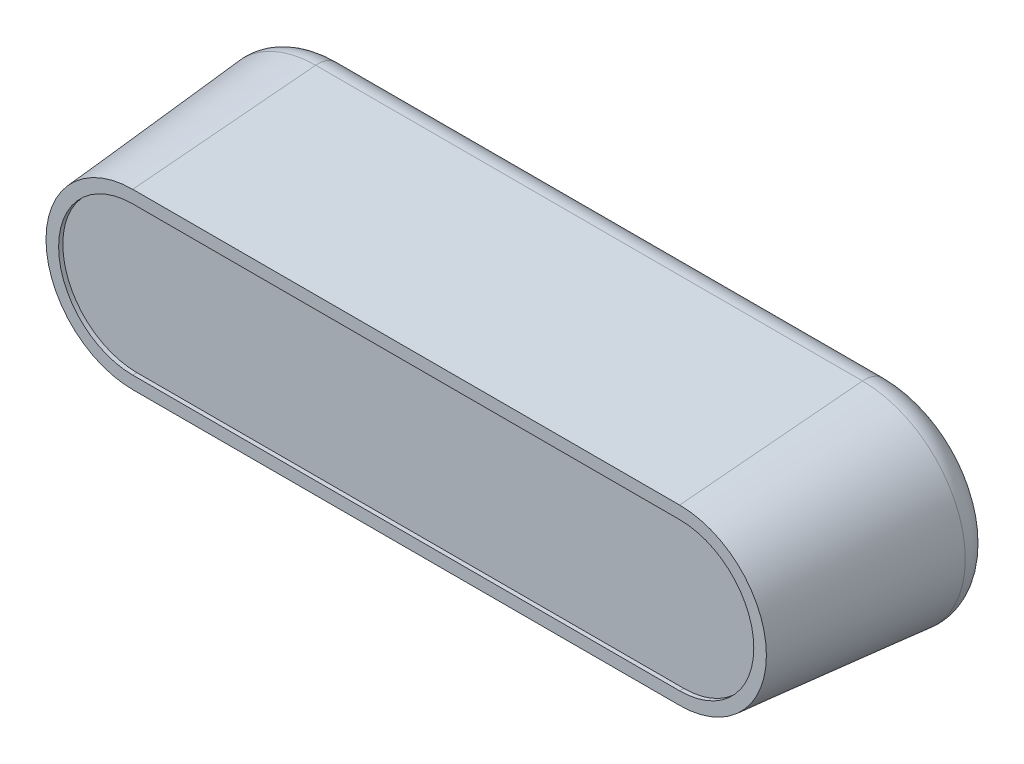
ISO-10303-21;
HEADER;
FILE_DESCRIPTION(('STEP AP214'),'2;1');
FILE_NAME('part.step','',(''),(''),'','','');
FILE_SCHEMA(('AUTOMOTIVE_DESIGN { 1 0 10303 214 1 1 1 1 }'));
ENDSEC;
DATA;
#1=APPLICATION_CONTEXT('core data for automotive mechanical design processes');
#2=APPLICATION_PROTOCOL_DEFINITION('international standard','automotive_design',2000,#1);
#3=PRODUCT_CONTEXT('',#1,'mechanical');
#4=PRODUCT('Part','Part','',(#3));
#5=PRODUCT_RELATED_PRODUCT_CATEGORY('part','',(#4));
#6=PRODUCT_DEFINITION_FORMATION('','',#4);
#7=PRODUCT_DEFINITION_CONTEXT('part definition',#1,'design');
#8=PRODUCT_DEFINITION('design','',#6,#7);
#9=PRODUCT_DEFINITION_SHAPE('','',#8);
#10=(LENGTH_UNIT() NAMED_UNIT(*) SI_UNIT(.MILLI.,.METRE.));
#11=(NAMED_UNIT(*) PLANE_ANGLE_UNIT() SI_UNIT($,.RADIAN.));
#12=(NAMED_UNIT(*) SI_UNIT($,.STERADIAN.) SOLID_ANGLE_UNIT());
#13=UNCERTAINTY_MEASURE_WITH_UNIT(LENGTH_MEASURE(1.E-05),#10,'distance_accuracy_value','');
#14=(GEOMETRIC_REPRESENTATION_CONTEXT(3) GLOBAL_UNCERTAINTY_ASSIGNED_CONTEXT((#13)) GLOBAL_UNIT_ASSIGNED_CONTEXT((#10,
#11,#12)) REPRESENTATION_CONTEXT('',''));
#15=CARTESIAN_POINT('',(0.,0.,0.));
#16=DIRECTION('',(0.,0.,1.));
#17=DIRECTION('',(1.,0.,0.));
#18=AXIS2_PLACEMENT_3D('',#15,#16,#17);
#19=CARTESIAN_POINT('',(-32.5,-12.5,0.));
#20=DIRECTION('',(0.,-0.996194698091746,0.0871557427476583));
#21=DIRECTION('',(0.,-0.0871557427476583,-0.996194698091746));
#22=AXIS2_PLACEMENT_3D('',#19,#20,#21);
#23=PLANE('',#22);
#24=DIRECTION('',(-1.,0.,0.));
#25=VECTOR('',#24,1.);
#26=CARTESIAN_POINT('',(32.5,-11.4272606193341,12.261467228243));
#27=LINE('',#26,#25);
#28=CARTESIAN_POINT('',(-32.5,-11.4272606193341,12.261467228243));
#29=VERTEX_POINT('',#28);
#30=CARTESIAN_POINT('',(32.5,-11.4272606193341,12.261467228243));
#31=VERTEX_POINT('',#30);
#32=EDGE_CURVE('E61',#29,#31,#27,.F.);
#33=ORIENTED_EDGE('',*,*,#32,.T.);
#34=DIRECTION('',(0.,-0.0871557427476583,-0.996194698091745));
#35=VECTOR('',#34,1.);
#36=CARTESIAN_POINT('',(32.5,-12.5,0.));
#37=LINE('',#36,#35);
#38=CARTESIAN_POINT('',(32.5,-10.3127834118519,25.));
#39=VERTEX_POINT('',#38);
#40=EDGE_CURVE('E163',#39,#31,#37,.T.);
#41=ORIENTED_EDGE('',*,*,#40,.F.);
#42=DIRECTION('',(-1.,0.,0.));
#43=VECTOR('',#42,1.);
#44=CARTESIAN_POINT('',(-32.5,-10.3127834118519,25.));
#45=LINE('',#44,#43);
#46=CARTESIAN_POINT('',(-32.5,-10.3127834118519,25.));
#47=VERTEX_POINT('',#46);
#48=EDGE_CURVE('E237',#47,#39,#45,.F.);
#49=ORIENTED_EDGE('',*,*,#48,.F.);
#50=DIRECTION('',(0.,-0.0871557427476583,-0.996194698091745));
#51=VECTOR('',#50,1.);
#52=CARTESIAN_POINT('',(-32.5,-12.5,0.));
#53=LINE('',#52,#51);
#54=EDGE_CURVE('E176',#47,#29,#53,.T.);
#55=ORIENTED_EDGE('',*,*,#54,.T.);
#56=EDGE_LOOP('',(#33,#41,#49,#55));
#57=FACE_BOUND('',#56,.T.);
#58=ADVANCED_FACE('F38',(#57),#23,.T.);
#59=CARTESIAN_POINT('',(-32.5,0.,0.));
#60=DIRECTION('',(0.,0.,-1.));
#61=DIRECTION('',(1.,0.,0.));
#62=AXIS2_PLACEMENT_3D('',#59,#60,#61);
#63=CONICAL_SURFACE('',#62,12.5,0.0872664625997166);
#64=DIRECTION('',(0.,0.0871557427476583,-0.996194698091745));
#65=VECTOR('',#64,1.);
#66=CARTESIAN_POINT('',(-32.5,12.5,0.));
#67=LINE('',#66,#65);
#68=CARTESIAN_POINT('',(-32.5,10.3127834118519,25.));
#69=VERTEX_POINT('',#68);
#70=CARTESIAN_POINT('',(-32.5,12.2146585910674,3.26146722824297));
#71=VERTEX_POINT('',#70);
#72=EDGE_CURVE('E227',#69,#71,#67,.T.);
#73=ORIENTED_EDGE('',*,*,#72,.T.);
#74=CARTESIAN_POINT('',(-32.5,0.,3.26146722824297));
#75=DIRECTION('',(0.,0.,1.));
#76=DIRECTION('',(1.,0.,0.));
#77=AXIS2_PLACEMENT_3D('',#74,#75,#76);
#78=CIRCLE('',#77,12.2146585910674);
#79=CARTESIAN_POINT('',(-32.5,-12.2146585910674,3.26146722824297));
#80=VERTEX_POINT('',#79);
#81=EDGE_CURVE('E11',#71,#80,#78,.T.);
#82=ORIENTED_EDGE('',*,*,#81,.T.);
#83=DIRECTION('',(0.,-0.0871557427476583,-0.996194698091746));
#84=VECTOR('',#83,1.);
#85=CARTESIAN_POINT('',(-32.5,0.,142.875653784517));
#86=LINE('',#85,#84);
#87=EDGE_CURVE('E54',#80,#29,#86,.F.);
#88=ORIENTED_EDGE('',*,*,#87,.T.);
#89=ORIENTED_EDGE('',*,*,#54,.F.);
#90=CARTESIAN_POINT('',(-32.5,0.,25.));
#91=DIRECTION('',(0.,0.,1.));
#92=DIRECTION('',(1.,0.,0.));
#93=AXIS2_PLACEMENT_3D('',#90,#91,#92);
#94=CIRCLE('',#93,10.3127834118519);
#95=EDGE_CURVE('E234',#69,#47,#94,.T.);
#96=ORIENTED_EDGE('',*,*,#95,.F.);
#97=EDGE_LOOP('',(#73,#82,#88,#89,#96));
#98=FACE_BOUND('',#97,.T.);
#99=ADVANCED_FACE('F273',(#98),#63,.T.);
#100=CARTESIAN_POINT('',(32.5,0.,0.));
#101=DIRECTION('',(0.,0.,-1.));
#102=DIRECTION('',(1.,0.,0.));
#103=AXIS2_PLACEMENT_3D('',#100,#101,#102);
#104=CONICAL_SURFACE('',#103,12.5,0.0872664625997166);
#105=ORIENTED_EDGE('',*,*,#40,.T.);
#106=DIRECTION('',(0.,0.0871557427476583,0.996194698091746));
#107=VECTOR('',#106,1.);
#108=CARTESIAN_POINT('',(32.5,-12.0289885720037,5.38368525719598));
#109=LINE('',#108,#107);
#110=CARTESIAN_POINT('',(32.5,-12.2146585910674,3.26146722824297));
#111=VERTEX_POINT('',#110);
#112=EDGE_CURVE('E160',#31,#111,#109,.F.);
#113=ORIENTED_EDGE('',*,*,#112,.T.);
#114=CARTESIAN_POINT('',(32.5,0.,3.26146722824297));
#115=DIRECTION('',(0.,0.,1.));
#116=DIRECTION('',(1.,0.,0.));
#117=AXIS2_PLACEMENT_3D('',#114,#115,#116);
#118=CIRCLE('',#117,12.2146585910674);
#119=CARTESIAN_POINT('',(32.5,12.2146585910674,3.26146722824297));
#120=VERTEX_POINT('',#119);
#121=EDGE_CURVE('E136',#111,#120,#118,.T.);
#122=ORIENTED_EDGE('',*,*,#121,.T.);
#123=DIRECTION('',(0.,0.0871557427476583,-0.996194698091745));
#124=VECTOR('',#123,1.);
#125=CARTESIAN_POINT('',(32.5,12.5,0.));
#126=LINE('',#125,#124);
#127=CARTESIAN_POINT('',(32.5,10.3127834118519,25.));
#128=VERTEX_POINT('',#127);
#129=EDGE_CURVE('E230',#128,#120,#126,.T.);
#130=ORIENTED_EDGE('',*,*,#129,.F.);
#131=CARTESIAN_POINT('',(32.5,0.,25.));
#132=DIRECTION('',(0.,0.,1.));
#133=DIRECTION('',(1.,0.,0.));
#134=AXIS2_PLACEMENT_3D('',#131,#132,#133);
#135=CIRCLE('',#134,10.3127834118519);
#136=EDGE_CURVE('E239',#39,#128,#135,.T.);
#137=ORIENTED_EDGE('',*,*,#136,.F.);
#138=EDGE_LOOP('',(#105,#113,#122,#130,#137));
#139=FACE_BOUND('',#138,.T.);
#140=ADVANCED_FACE('F161',(#139),#104,.T.);
#141=CARTESIAN_POINT('',(-32.5,12.5,0.));
#142=DIRECTION('',(0.,0.996194698091746,0.0871557427476583));
#143=DIRECTION('',(0.,-0.0871557427476583,0.996194698091746));
#144=AXIS2_PLACEMENT_3D('',#141,#142,#143);
#145=PLANE('',#144);
#146=ORIENTED_EDGE('',*,*,#129,.T.);
#147=DIRECTION('',(-1.,0.,0.));
#148=VECTOR('',#147,1.);
#149=CARTESIAN_POINT('',(-32.5,12.2146585910674,3.26146722824298));
#150=LINE('',#149,#148);
#151=EDGE_CURVE('E47',#120,#71,#150,.T.);
#152=ORIENTED_EDGE('',*,*,#151,.T.);
#153=ORIENTED_EDGE('',*,*,#72,.F.);
#154=DIRECTION('',(1.,0.,0.));
#155=VECTOR('',#154,1.);
#156=CARTESIAN_POINT('',(-32.5,10.3127834118519,25.));
#157=LINE('',#156,#155);
#158=EDGE_CURVE('E231',#128,#69,#157,.F.);
#159=ORIENTED_EDGE('',*,*,#158,.F.);
#160=EDGE_LOOP('',(#146,#152,#153,#159));
#161=FACE_BOUND('',#160,.T.);
#162=ADVANCED_FACE('F268',(#161),#145,.T.);
#163=CARTESIAN_POINT('',(-32.5,0.,25.));
#164=DIRECTION('',(0.,0.,1.));
#165=DIRECTION('',(1.,0.,0.));
#166=AXIS2_PLACEMENT_3D('',#163,#164,#165);
#167=PLANE('',#166);
#168=DIRECTION('',(1.,0.,0.));
#169=VECTOR('',#168,1.);
#170=CARTESIAN_POINT('',(0.,-8.8127834118519,25.));
#171=LINE('',#170,#169);
#172=CARTESIAN_POINT('',(-32.5,-8.8127834118519,25.));
#173=VERTEX_POINT('',#172);
#174=CARTESIAN_POINT('',(32.5,-8.81278341185189,25.));
#175=VERTEX_POINT('',#174);
#176=EDGE_CURVE('E209',#173,#175,#171,.T.);
#177=ORIENTED_EDGE('',*,*,#176,.F.);
#178=CARTESIAN_POINT('',(-32.5,0.,25.));
#179=DIRECTION('',(0.,0.,1.));
#180=DIRECTION('',(1.,0.,0.));
#181=AXIS2_PLACEMENT_3D('',#178,#179,#180);
#182=CIRCLE('',#181,8.8127834118519);
#183=CARTESIAN_POINT('',(-32.5,8.81278341185191,25.));
#184=VERTEX_POINT('',#183);
#185=EDGE_CURVE('E199',#184,#173,#182,.T.);
#186=ORIENTED_EDGE('',*,*,#185,.F.);
#187=DIRECTION('',(-1.,0.,0.));
#188=VECTOR('',#187,1.);
#189=CARTESIAN_POINT('',(0.,8.81278341185191,25.));
#190=LINE('',#189,#188);
#191=CARTESIAN_POINT('',(32.5,8.81278341185191,25.));
#192=VERTEX_POINT('',#191);
#193=EDGE_CURVE('E214',#192,#184,#190,.T.);
#194=ORIENTED_EDGE('',*,*,#193,.F.);
#195=CARTESIAN_POINT('',(32.5,0.,25.));
#196=DIRECTION('',(0.,0.,1.));
#197=DIRECTION('',(1.,0.,0.));
#198=AXIS2_PLACEMENT_3D('',#195,#196,#197);
#199=CIRCLE('',#198,8.8127834118519);
#200=EDGE_CURVE('E211',#175,#192,#199,.T.);
#201=ORIENTED_EDGE('',*,*,#200,.F.);
#202=EDGE_LOOP('',(#177,#186,#194,#201));
#203=FACE_BOUND('',#202,.T.);
#204=ORIENTED_EDGE('',*,*,#95,.T.);
#205=ORIENTED_EDGE('',*,*,#48,.T.);
#206=ORIENTED_EDGE('',*,*,#136,.T.);
#207=ORIENTED_EDGE('',*,*,#158,.T.);
#208=EDGE_LOOP('',(#204,#205,#206,#207));
#209=FACE_BOUND('',#208,.T.);
#210=ADVANCED_FACE('F262',(#203,#209),#167,.T.);
#211=CARTESIAN_POINT('',(-32.5,0.,0.));
#212=DIRECTION('',(0.,0.,1.));
#213=DIRECTION('',(1.,0.,0.));
#214=AXIS2_PLACEMENT_3D('',#211,#212,#213);
#215=PLANE('',#214);
#216=CARTESIAN_POINT('',(32.5,0.,0.));
#217=DIRECTION('',(0.,0.,1.));
#218=DIRECTION('',(1.,0.,0.));
#219=AXIS2_PLACEMENT_3D('',#216,#217,#218);
#220=CIRCLE('',#219,9.22607449679219);
#221=CARTESIAN_POINT('',(32.5,9.2260744967922,0.));
#222=VERTEX_POINT('',#221);
#223=CARTESIAN_POINT('',(32.5,-9.22607449679217,0.));
#224=VERTEX_POINT('',#223);
#225=EDGE_CURVE('E245',#222,#224,#220,.F.);
#226=ORIENTED_EDGE('',*,*,#225,.T.);
#227=DIRECTION('',(-1.,0.,0.));
#228=VECTOR('',#227,1.);
#229=CARTESIAN_POINT('',(-32.5,-9.22607449679219,0.));
#230=LINE('',#229,#228);
#231=CARTESIAN_POINT('',(-32.5,-9.22607449679219,0.));
#232=VERTEX_POINT('',#231);
#233=EDGE_CURVE('E147',#224,#232,#230,.T.);
#234=ORIENTED_EDGE('',*,*,#233,.T.);
#235=CARTESIAN_POINT('',(-32.5,0.,0.));
#236=DIRECTION('',(0.,0.,1.));
#237=DIRECTION('',(1.,0.,0.));
#238=AXIS2_PLACEMENT_3D('',#235,#236,#237);
#239=CIRCLE('',#238,9.22607449679219);
#240=CARTESIAN_POINT('',(-32.5,9.22607449679219,0.));
#241=VERTEX_POINT('',#240);
#242=EDGE_CURVE('E175',#232,#241,#239,.F.);
#243=ORIENTED_EDGE('',*,*,#242,.T.);
#244=DIRECTION('',(1.,0.,0.));
#245=VECTOR('',#244,1.);
#246=CARTESIAN_POINT('',(-32.5,9.22607449679219,0.));
#247=LINE('',#246,#245);
#248=EDGE_CURVE('E243',#241,#222,#247,.T.);
#249=ORIENTED_EDGE('',*,*,#248,.T.);
#250=EDGE_LOOP('',(#226,#234,#243,#249));
#251=FACE_BOUND('',#250,.T.);
#252=ADVANCED_FACE('F260',(#251),#215,.F.);
#253=CARTESIAN_POINT('',(-32.5,9.22607449679219,3.));
#254=DIRECTION('',(1.,0.,0.));
#255=DIRECTION('',(0.,1.,0.));
#256=AXIS2_PLACEMENT_3D('',#253,#254,#255);
#257=CYLINDRICAL_SURFACE('',#256,3.);
#258=CARTESIAN_POINT('',(32.5,9.2260744967922,3.));
#259=DIRECTION('',(1.,0.,0.));
#260=DIRECTION('',(0.,0.,-1.));
#261=AXIS2_PLACEMENT_3D('',#258,#259,#260);
#262=CIRCLE('',#261,3.);
#263=EDGE_CURVE('E142',#222,#120,#262,.T.);
#264=ORIENTED_EDGE('',*,*,#263,.F.);
#265=ORIENTED_EDGE('',*,*,#248,.F.);
#266=CARTESIAN_POINT('',(-32.5,9.22607449679218,3.));
#267=DIRECTION('',(-1.,0.,0.));
#268=DIRECTION('',(0.,0.,1.));
#269=AXIS2_PLACEMENT_3D('',#266,#267,#268);
#270=CIRCLE('',#269,3.);
#271=EDGE_CURVE('E42',#71,#241,#270,.T.);
#272=ORIENTED_EDGE('',*,*,#271,.F.);
#273=ORIENTED_EDGE('',*,*,#151,.F.);
#274=EDGE_LOOP('',(#264,#265,#272,#273));
#275=FACE_BOUND('',#274,.T.);
#276=ADVANCED_FACE('F40',(#275),#257,.T.);
#277=CARTESIAN_POINT('',(-32.5,0.,3.));
#278=DIRECTION('',(0.,0.,1.));
#279=DIRECTION('',(1.,0.,0.));
#280=AXIS2_PLACEMENT_3D('',#277,#278,#279);
#281=TOROIDAL_SURFACE('',#280,9.22607449679219,3.);
#282=ORIENTED_EDGE('',*,*,#271,.T.);
#283=ORIENTED_EDGE('',*,*,#242,.F.);
#284=CARTESIAN_POINT('',(-32.5,-9.22607449679218,3.));
#285=DIRECTION('',(1.,0.,0.));
#286=DIRECTION('',(0.,0.,-1.));
#287=AXIS2_PLACEMENT_3D('',#284,#285,#286);
#288=CIRCLE('',#287,3.);
#289=EDGE_CURVE('E156',#80,#232,#288,.T.);
#290=ORIENTED_EDGE('',*,*,#289,.F.);
#291=ORIENTED_EDGE('',*,*,#81,.F.);
#292=EDGE_LOOP('',(#282,#283,#290,#291));
#293=FACE_BOUND('',#292,.T.);
#294=ADVANCED_FACE('F254',(#293),#281,.T.);
#295=CARTESIAN_POINT('',(32.5,0.,3.));
#296=DIRECTION('',(0.,0.,1.));
#297=DIRECTION('',(1.,0.,0.));
#298=AXIS2_PLACEMENT_3D('',#295,#296,#297);
#299=TOROIDAL_SURFACE('',#298,9.22607449679219,3.);
#300=ORIENTED_EDGE('',*,*,#263,.T.);
#301=ORIENTED_EDGE('',*,*,#121,.F.);
#302=CARTESIAN_POINT('',(32.5,-9.22607449679217,3.));
#303=DIRECTION('',(-1.,0.,0.));
#304=DIRECTION('',(0.,0.,1.));
#305=AXIS2_PLACEMENT_3D('',#302,#303,#304);
#306=CIRCLE('',#305,3.);
#307=EDGE_CURVE('E140',#224,#111,#306,.T.);
#308=ORIENTED_EDGE('',*,*,#307,.F.);
#309=ORIENTED_EDGE('',*,*,#225,.F.);
#310=EDGE_LOOP('',(#300,#301,#308,#309));
#311=FACE_BOUND('',#310,.T.);
#312=ADVANCED_FACE('F138',(#311),#299,.T.);
#313=CARTESIAN_POINT('',(-32.5,-9.22607449679219,3.));
#314=DIRECTION('',(-1.,0.,0.));
#315=DIRECTION('',(0.,-1.,0.));
#316=AXIS2_PLACEMENT_3D('',#313,#314,#315);
#317=CYLINDRICAL_SURFACE('',#316,3.);
#318=ORIENTED_EDGE('',*,*,#289,.T.);
#319=ORIENTED_EDGE('',*,*,#233,.F.);
#320=ORIENTED_EDGE('',*,*,#307,.T.);
#321=DIRECTION('',(1.,0.,0.));
#322=VECTOR('',#321,1.);
#323=CARTESIAN_POINT('',(-32.5,-12.2146585910674,3.26146722824298));
#324=LINE('',#323,#322);
#325=EDGE_CURVE('E154',#80,#111,#324,.T.);
#326=ORIENTED_EDGE('',*,*,#325,.F.);
#327=EDGE_LOOP('',(#318,#319,#320,#326));
#328=FACE_BOUND('',#327,.T.);
#329=ADVANCED_FACE('F152',(#328),#317,.T.);
#330=CARTESIAN_POINT('',(0.,-8.8127834118519,24.5));
#331=DIRECTION('',(0.,-1.,0.));
#332=DIRECTION('',(0.,0.,-1.));
#333=AXIS2_PLACEMENT_3D('',#330,#331,#332);
#334=PLANE('',#333);
#335=ORIENTED_EDGE('',*,*,#176,.T.);
#336=DIRECTION('',(0.,0.,1.));
#337=VECTOR('',#336,1.);
#338=CARTESIAN_POINT('',(32.5,-8.8127834118519,24.5));
#339=LINE('',#338,#337);
#340=CARTESIAN_POINT('',(32.5,-8.8127834118519,24.5));
#341=VERTEX_POINT('',#340);
#342=EDGE_CURVE('E208',#341,#175,#339,.T.);
#343=ORIENTED_EDGE('',*,*,#342,.F.);
#344=DIRECTION('',(1.,0.,0.));
#345=VECTOR('',#344,1.);
#346=CARTESIAN_POINT('',(0.,-8.8127834118519,24.5));
#347=LINE('',#346,#345);
#348=CARTESIAN_POINT('',(-32.5,-8.8127834118519,24.5));
#349=VERTEX_POINT('',#348);
#350=EDGE_CURVE('E195',#349,#341,#347,.T.);
#351=ORIENTED_EDGE('',*,*,#350,.F.);
#352=DIRECTION('',(0.,0.,1.));
#353=VECTOR('',#352,1.);
#354=CARTESIAN_POINT('',(-32.5,-8.8127834118519,24.5));
#355=LINE('',#354,#353);
#356=EDGE_CURVE('E157',#349,#173,#355,.T.);
#357=ORIENTED_EDGE('',*,*,#356,.T.);
#358=EDGE_LOOP('',(#335,#343,#351,#357));
#359=FACE_BOUND('',#358,.T.);
#360=ADVANCED_FACE('F283',(#359),#334,.F.);
#361=CARTESIAN_POINT('',(-32.5,0.,24.5));
#362=DIRECTION('',(0.,0.,1.));
#363=DIRECTION('',(1.,0.,0.));
#364=AXIS2_PLACEMENT_3D('',#361,#362,#363);
#365=CYLINDRICAL_SURFACE('',#364,8.8127834118519);
#366=ORIENTED_EDGE('',*,*,#185,.T.);
#367=ORIENTED_EDGE('',*,*,#356,.F.);
#368=CARTESIAN_POINT('',(-32.5,0.,24.5));
#369=DIRECTION('',(0.,0.,1.));
#370=DIRECTION('',(1.,0.,0.));
#371=AXIS2_PLACEMENT_3D('',#368,#369,#370);
#372=CIRCLE('',#371,8.8127834118519);
#373=CARTESIAN_POINT('',(-32.5,8.81278341185191,24.5));
#374=VERTEX_POINT('',#373);
#375=EDGE_CURVE('E205',#374,#349,#372,.T.);
#376=ORIENTED_EDGE('',*,*,#375,.F.);
#377=DIRECTION('',(0.,0.,1.));
#378=VECTOR('',#377,1.);
#379=CARTESIAN_POINT('',(-32.5,8.81278341185191,24.5));
#380=LINE('',#379,#378);
#381=EDGE_CURVE('E220',#374,#184,#380,.T.);
#382=ORIENTED_EDGE('',*,*,#381,.T.);
#383=EDGE_LOOP('',(#366,#367,#376,#382));
#384=FACE_BOUND('',#383,.T.);
#385=ADVANCED_FACE('F307',(#384),#365,.F.);
#386=CARTESIAN_POINT('',(0.,8.81278341185191,24.5));
#387=DIRECTION('',(0.,1.,0.));
#388=DIRECTION('',(0.,0.,1.));
#389=AXIS2_PLACEMENT_3D('',#386,#387,#388);
#390=PLANE('',#389);
#391=ORIENTED_EDGE('',*,*,#193,.T.);
#392=ORIENTED_EDGE('',*,*,#381,.F.);
#393=DIRECTION('',(-1.,0.,0.));
#394=VECTOR('',#393,1.);
#395=CARTESIAN_POINT('',(0.,8.81278341185191,24.5));
#396=LINE('',#395,#394);
#397=CARTESIAN_POINT('',(32.5,8.81278341185191,24.5));
#398=VERTEX_POINT('',#397);
#399=EDGE_CURVE('E202',#398,#374,#396,.T.);
#400=ORIENTED_EDGE('',*,*,#399,.F.);
#401=DIRECTION('',(0.,0.,1.));
#402=VECTOR('',#401,1.);
#403=CARTESIAN_POINT('',(32.5,8.81278341185191,24.5));
#404=LINE('',#403,#402);
#405=EDGE_CURVE('E222',#398,#192,#404,.T.);
#406=ORIENTED_EDGE('',*,*,#405,.T.);
#407=EDGE_LOOP('',(#391,#392,#400,#406));
#408=FACE_BOUND('',#407,.T.);
#409=ADVANCED_FACE('F315',(#408),#390,.F.);
#410=CARTESIAN_POINT('',(32.5,0.,24.5));
#411=DIRECTION('',(0.,0.,1.));
#412=DIRECTION('',(1.,0.,0.));
#413=AXIS2_PLACEMENT_3D('',#410,#411,#412);
#414=CYLINDRICAL_SURFACE('',#413,8.8127834118519);
#415=ORIENTED_EDGE('',*,*,#200,.T.);
#416=ORIENTED_EDGE('',*,*,#405,.F.);
#417=CARTESIAN_POINT('',(32.5,0.,24.5));
#418=DIRECTION('',(0.,0.,1.));
#419=DIRECTION('',(1.,0.,0.));
#420=AXIS2_PLACEMENT_3D('',#417,#418,#419);
#421=CIRCLE('',#420,8.8127834118519);
#422=EDGE_CURVE('E198',#341,#398,#421,.T.);
#423=ORIENTED_EDGE('',*,*,#422,.F.);
#424=ORIENTED_EDGE('',*,*,#342,.T.);
#425=EDGE_LOOP('',(#415,#416,#423,#424));
#426=FACE_BOUND('',#425,.T.);
#427=ADVANCED_FACE('F323',(#426),#414,.F.);
#428=CARTESIAN_POINT('',(0.,0.,24.5));
#429=DIRECTION('',(0.,0.,1.));
#430=DIRECTION('',(1.,0.,0.));
#431=AXIS2_PLACEMENT_3D('',#428,#429,#430);
#432=PLANE('',#431);
#433=ORIENTED_EDGE('',*,*,#350,.T.);
#434=ORIENTED_EDGE('',*,*,#422,.T.);
#435=ORIENTED_EDGE('',*,*,#399,.T.);
#436=ORIENTED_EDGE('',*,*,#375,.T.);
#437=EDGE_LOOP('',(#433,#434,#435,#436));
#438=FACE_BOUND('',#437,.T.);
#439=ADVANCED_FACE('F331',(#438),#432,.T.);
#440=CARTESIAN_POINT('',(32.5,12.2280744967922,3.26146722824297));
#441=DIRECTION('',(-1.,0.,0.));
#442=DIRECTION('',(0.,0.,1.));
#443=AXIS2_PLACEMENT_3D('',#440,#441,#442);
#444=PLANE('',#443);
#445=ORIENTED_EDGE('',*,*,#112,.F.);
#446=DIRECTION('',(0.,-1.,0.));
#447=VECTOR('',#446,1.);
#448=CARTESIAN_POINT('',(32.5,12.2280744967922,12.261467228243));
#449=LINE('',#448,#447);
#450=CARTESIAN_POINT('',(32.5,-12.5,12.261467228243));
#451=VERTEX_POINT('',#450);
#452=EDGE_CURVE('E190',#31,#451,#449,.T.);
#453=ORIENTED_EDGE('',*,*,#452,.T.);
#454=DIRECTION('',(0.,0.,-1.));
#455=VECTOR('',#454,1.);
#456=CARTESIAN_POINT('',(32.5,-12.5,3.26146722824297));
#457=LINE('',#456,#455);
#458=CARTESIAN_POINT('',(32.5,-12.5,3.26146722824297));
#459=VERTEX_POINT('',#458);
#460=EDGE_CURVE('E181',#451,#459,#457,.T.);
#461=ORIENTED_EDGE('',*,*,#460,.T.);
#462=DIRECTION('',(0.,-1.,0.));
#463=VECTOR('',#462,1.);
#464=CARTESIAN_POINT('',(32.5,12.2280744967922,3.26146722824297));
#465=LINE('',#464,#463);
#466=EDGE_CURVE('E167',#111,#459,#465,.T.);
#467=ORIENTED_EDGE('',*,*,#466,.F.);
#468=EDGE_LOOP('',(#445,#453,#461,#467));
#469=FACE_BOUND('',#468,.T.);
#470=ADVANCED_FACE('F179',(#469),#444,.F.);
#471=CARTESIAN_POINT('',(32.5,12.2280744967922,3.26146722824297));
#472=DIRECTION('',(0.,0.,1.));
#473=DIRECTION('',(1.,0.,0.));
#474=AXIS2_PLACEMENT_3D('',#471,#472,#473);
#475=PLANE('',#474);
#476=ORIENTED_EDGE('',*,*,#325,.T.);
#477=ORIENTED_EDGE('',*,*,#466,.T.);
#478=DIRECTION('',(-1.,0.,0.));
#479=VECTOR('',#478,1.);
#480=CARTESIAN_POINT('',(32.5,-12.5,3.26146722824297));
#481=LINE('',#480,#479);
#482=CARTESIAN_POINT('',(-32.5,-12.5,3.26146722824297));
#483=VERTEX_POINT('',#482);
#484=EDGE_CURVE('E186',#459,#483,#481,.T.);
#485=ORIENTED_EDGE('',*,*,#484,.T.);
#486=DIRECTION('',(0.,-1.,0.));
#487=VECTOR('',#486,1.);
#488=CARTESIAN_POINT('',(-32.5,12.2280744967922,3.26146722824297));
#489=LINE('',#488,#487);
#490=EDGE_CURVE('E174',#80,#483,#489,.T.);
#491=ORIENTED_EDGE('',*,*,#490,.F.);
#492=EDGE_LOOP('',(#476,#477,#485,#491));
#493=FACE_BOUND('',#492,.T.);
#494=ADVANCED_FACE('F171',(#493),#475,.F.);
#495=CARTESIAN_POINT('',(-32.5,12.2280744967922,3.26146722824297));
#496=DIRECTION('',(1.,0.,0.));
#497=DIRECTION('',(0.,0.,-1.));
#498=AXIS2_PLACEMENT_3D('',#495,#496,#497);
#499=PLANE('',#498);
#500=ORIENTED_EDGE('',*,*,#87,.F.);
#501=ORIENTED_EDGE('',*,*,#490,.T.);
#502=DIRECTION('',(0.,0.,1.));
#503=VECTOR('',#502,1.);
#504=CARTESIAN_POINT('',(-32.5,-12.5,3.26146722824297));
#505=LINE('',#504,#503);
#506=CARTESIAN_POINT('',(-32.5,-12.5,12.261467228243));
#507=VERTEX_POINT('',#506);
#508=EDGE_CURVE('E468',#483,#507,#505,.T.);
#509=ORIENTED_EDGE('',*,*,#508,.T.);
#510=DIRECTION('',(0.,-1.,0.));
#511=VECTOR('',#510,1.);
#512=CARTESIAN_POINT('',(-32.5,12.2280744967922,12.261467228243));
#513=LINE('',#512,#511);
#514=EDGE_CURVE('E183',#29,#507,#513,.T.);
#515=ORIENTED_EDGE('',*,*,#514,.F.);
#516=EDGE_LOOP('',(#500,#501,#509,#515));
#517=FACE_BOUND('',#516,.T.);
#518=ADVANCED_FACE('F353',(#517),#499,.F.);
#519=CARTESIAN_POINT('',(32.5,12.2280744967922,12.261467228243));
#520=DIRECTION('',(0.,0.,-1.));
#521=DIRECTION('',(-1.,0.,0.));
#522=AXIS2_PLACEMENT_3D('',#519,#520,#521);
#523=PLANE('',#522);
#524=ORIENTED_EDGE('',*,*,#32,.F.);
#525=ORIENTED_EDGE('',*,*,#514,.T.);
#526=DIRECTION('',(1.,0.,0.));
#527=VECTOR('',#526,1.);
#528=CARTESIAN_POINT('',(32.5,-12.5,12.261467228243));
#529=LINE('',#528,#527);
#530=EDGE_CURVE('E471',#507,#451,#529,.T.);
#531=ORIENTED_EDGE('',*,*,#530,.T.);
#532=ORIENTED_EDGE('',*,*,#452,.F.);
#533=EDGE_LOOP('',(#524,#525,#531,#532));
#534=FACE_BOUND('',#533,.T.);
#535=ADVANCED_FACE('F360',(#534),#523,.F.);
#536=CARTESIAN_POINT('',(0.,-12.5,0.));
#537=DIRECTION('',(0.,-1.,0.));
#538=DIRECTION('',(0.,0.,-1.));
#539=AXIS2_PLACEMENT_3D('',#536,#537,#538);
#540=PLANE('',#539);
#541=CARTESIAN_POINT('',(0.,-12.5,8.));
#542=DIRECTION('',(0.,-1.,0.));
#543=DIRECTION('',(0.,0.,-1.));
#544=AXIS2_PLACEMENT_3D('',#541,#542,#543);
#545=CIRCLE('',#544,2.5);
#546=CARTESIAN_POINT('',(0.,-12.5,5.5));
#547=VERTEX_POINT('',#546);
#548=EDGE_CURVE('E475',#547,#547,#545,.T.);
#549=ORIENTED_EDGE('',*,*,#548,.F.);
#550=EDGE_LOOP('',(#549));
#551=FACE_BOUND('',#550,.T.);
#552=ORIENTED_EDGE('',*,*,#460,.F.);
#553=ORIENTED_EDGE('',*,*,#530,.F.);
#554=ORIENTED_EDGE('',*,*,#508,.F.);
#555=ORIENTED_EDGE('',*,*,#484,.F.);
#556=EDGE_LOOP('',(#552,#553,#554,#555));
#557=FACE_BOUND('',#556,.T.);
#558=ADVANCED_FACE('F341',(#551,#557),#540,.T.);
#559=CARTESIAN_POINT('',(0.,-4.5,8.));
#560=DIRECTION('',(0.,-1.,0.));
#561=DIRECTION('',(0.,0.,-1.));
#562=AXIS2_PLACEMENT_3D('',#559,#560,#561);
#563=CYLINDRICAL_SURFACE('',#562,2.5);
#564=CARTESIAN_POINT('',(0.,-4.5,8.));
#565=DIRECTION('',(0.,-1.,0.));
#566=DIRECTION('',(0.,0.,-1.));
#567=AXIS2_PLACEMENT_3D('',#564,#565,#566);
#568=CIRCLE('',#567,2.5);
#569=CARTESIAN_POINT('',(0.,-4.5,5.5));
#570=VERTEX_POINT('',#569);
#571=EDGE_CURVE('E194',#570,#570,#568,.T.);
#572=ORIENTED_EDGE('',*,*,#571,.F.);
#573=EDGE_LOOP('',(#572));
#574=FACE_BOUND('',#573,.T.);
#575=ORIENTED_EDGE('',*,*,#548,.T.);
#576=EDGE_LOOP('',(#575));
#577=FACE_BOUND('',#576,.T.);
#578=ADVANCED_FACE('F347',(#574,#577),#563,.F.);
#579=CARTESIAN_POINT('',(0.,-4.5,8.));
#580=DIRECTION('',(0.,-1.,0.));
#581=DIRECTION('',(0.,0.,-1.));
#582=AXIS2_PLACEMENT_3D('',#579,#580,#581);
#583=PLANE('',#582);
#584=ORIENTED_EDGE('',*,*,#571,.T.);
#585=EDGE_LOOP('',(#584));
#586=FACE_BOUND('',#585,.T.);
#587=ADVANCED_FACE('F382',(#586),#583,.T.);
#588=CLOSED_SHELL('',(#58,#99,#140,#162,#210,#252,#276,#294,#312,#329,#360,#385,#409,#427,#439,
#470,#494,#518,#535,#558,#578,#587));
#589=MANIFOLD_SOLID_BREP('B2',#588);
#590=ADVANCED_BREP_SHAPE_REPRESENTATION('',(#18,#589),#14);
#591=SHAPE_DEFINITION_REPRESENTATION(#9,#590);
ENDSEC;
END-ISO-10303-21;
